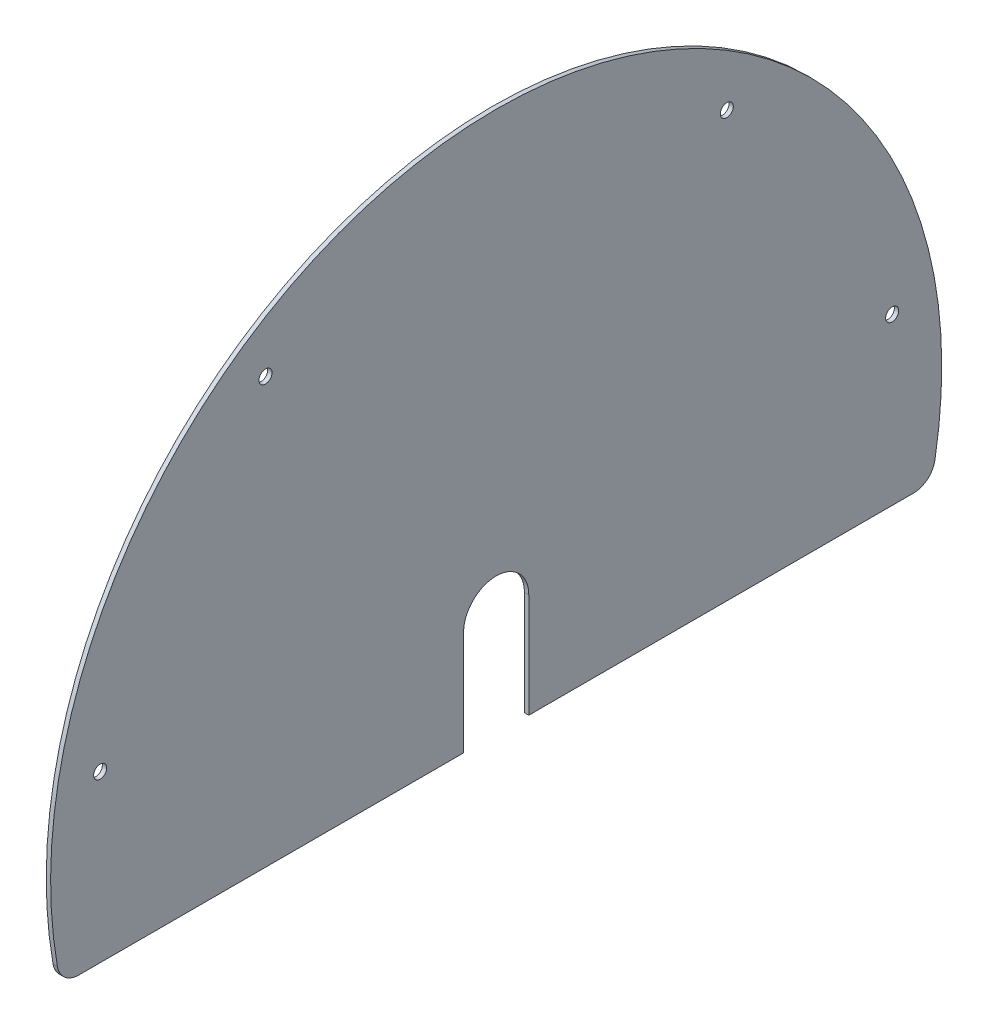
ISO-10303-21;
HEADER;
FILE_DESCRIPTION(('STEP AP214'),'2;1');
FILE_NAME('part.step','',(''),(''),'','','');
FILE_SCHEMA(('AUTOMOTIVE_DESIGN { 1 0 10303 214 1 1 1 1 }'));
ENDSEC;
DATA;
#1=APPLICATION_CONTEXT('core data for automotive mechanical design processes');
#2=APPLICATION_PROTOCOL_DEFINITION('international standard','automotive_design',2000,#1);
#3=PRODUCT_CONTEXT('',#1,'mechanical');
#4=PRODUCT('Part','Part','',(#3));
#5=PRODUCT_RELATED_PRODUCT_CATEGORY('part','',(#4));
#6=PRODUCT_DEFINITION_FORMATION('','',#4);
#7=PRODUCT_DEFINITION_CONTEXT('part definition',#1,'design');
#8=PRODUCT_DEFINITION('design','',#6,#7);
#9=PRODUCT_DEFINITION_SHAPE('','',#8);
#10=(LENGTH_UNIT() NAMED_UNIT(*) SI_UNIT(.MILLI.,.METRE.));
#11=(NAMED_UNIT(*) PLANE_ANGLE_UNIT() SI_UNIT($,.RADIAN.));
#12=(NAMED_UNIT(*) SI_UNIT($,.STERADIAN.) SOLID_ANGLE_UNIT());
#13=UNCERTAINTY_MEASURE_WITH_UNIT(LENGTH_MEASURE(1.E-05),#10,'distance_accuracy_value','');
#14=(GEOMETRIC_REPRESENTATION_CONTEXT(3) GLOBAL_UNCERTAINTY_ASSIGNED_CONTEXT((#13)) GLOBAL_UNIT_ASSIGNED_CONTEXT((#10,
#11,#12)) REPRESENTATION_CONTEXT('',''));
#15=CARTESIAN_POINT('',(0.,0.,0.));
#16=DIRECTION('',(0.,0.,1.));
#17=DIRECTION('',(1.,0.,0.));
#18=AXIS2_PLACEMENT_3D('',#15,#16,#17);
#19=CARTESIAN_POINT('',(-2.,48.,15.));
#20=DIRECTION('',(0.,0.,-1.));
#21=DIRECTION('',(0.,1.,0.));
#22=AXIS2_PLACEMENT_3D('',#19,#20,#21);
#23=PLANE('',#22);
#24=DIRECTION('',(0.,1.,0.));
#25=VECTOR('',#24,1.);
#26=CARTESIAN_POINT('',(0.,48.,15.));
#27=LINE('',#26,#25);
#28=CARTESIAN_POINT('',(0.,0.,15.));
#29=VERTEX_POINT('',#28);
#30=CARTESIAN_POINT('',(0.,48.,15.));
#31=VERTEX_POINT('',#30);
#32=EDGE_CURVE('E138',#29,#31,#27,.T.);
#33=ORIENTED_EDGE('',*,*,#32,.F.);
#34=DIRECTION('',(1.,0.,0.));
#35=VECTOR('',#34,1.);
#36=CARTESIAN_POINT('',(-2.,0.,15.));
#37=LINE('',#36,#35);
#38=CARTESIAN_POINT('',(-2.,0.,15.));
#39=VERTEX_POINT('',#38);
#40=EDGE_CURVE('E122',#39,#29,#37,.T.);
#41=ORIENTED_EDGE('',*,*,#40,.F.);
#42=DIRECTION('',(0.,1.,0.));
#43=VECTOR('',#42,1.);
#44=CARTESIAN_POINT('',(-2.,48.,15.));
#45=LINE('',#44,#43);
#46=CARTESIAN_POINT('',(-2.,48.,15.));
#47=VERTEX_POINT('',#46);
#48=EDGE_CURVE('E115',#39,#47,#45,.T.);
#49=ORIENTED_EDGE('',*,*,#48,.T.);
#50=DIRECTION('',(1.,0.,0.));
#51=VECTOR('',#50,1.);
#52=CARTESIAN_POINT('',(-2.,48.,15.));
#53=LINE('',#52,#51);
#54=EDGE_CURVE('E99',#47,#31,#53,.T.);
#55=ORIENTED_EDGE('',*,*,#54,.T.);
#56=EDGE_LOOP('',(#33,#41,#49,#55));
#57=FACE_BOUND('',#56,.T.);
#58=ADVANCED_FACE('F34',(#57),#23,.T.);
#59=CARTESIAN_POINT('',(-2.,0.,15.));
#60=DIRECTION('',(0.,-1.,0.));
#61=DIRECTION('',(0.,0.,-1.));
#62=AXIS2_PLACEMENT_3D('',#59,#60,#61);
#63=PLANE('',#62);
#64=DIRECTION('',(0.,0.,-1.));
#65=VECTOR('',#64,1.);
#66=CARTESIAN_POINT('',(0.,0.,15.));
#67=LINE('',#66,#65);
#68=CARTESIAN_POINT('',(0.,0.,192.013020391847));
#69=VERTEX_POINT('',#68);
#70=EDGE_CURVE('E123',#69,#29,#67,.T.);
#71=ORIENTED_EDGE('',*,*,#70,.F.);
#72=DIRECTION('',(1.,0.,0.));
#73=VECTOR('',#72,1.);
#74=CARTESIAN_POINT('',(-2.,0.,192.013020391847));
#75=LINE('',#74,#73);
#76=CARTESIAN_POINT('',(-2.,0.,192.013020391847));
#77=VERTEX_POINT('',#76);
#78=EDGE_CURVE('E11',#69,#77,#75,.F.);
#79=ORIENTED_EDGE('',*,*,#78,.T.);
#80=DIRECTION('',(0.,0.,-1.));
#81=VECTOR('',#80,1.);
#82=CARTESIAN_POINT('',(-2.,0.,15.));
#83=LINE('',#82,#81);
#84=EDGE_CURVE('E110',#77,#39,#83,.T.);
#85=ORIENTED_EDGE('',*,*,#84,.T.);
#86=ORIENTED_EDGE('',*,*,#40,.T.);
#87=EDGE_LOOP('',(#71,#79,#85,#86));
#88=FACE_BOUND('',#87,.T.);
#89=ADVANCED_FACE('F181',(#88),#63,.T.);
#90=CARTESIAN_POINT('',(-2.,44.,0.));
#91=DIRECTION('',(1.,0.,0.));
#92=DIRECTION('',(0.,0.,-1.));
#93=AXIS2_PLACEMENT_3D('',#90,#91,#92);
#94=CYLINDRICAL_SURFACE('',#93,205.);
#95=CARTESIAN_POINT('',(0.,44.,0.));
#96=DIRECTION('',(1.,0.,0.));
#97=DIRECTION('',(0.,0.,1.));
#98=AXIS2_PLACEMENT_3D('',#95,#96,#97);
#99=CIRCLE('',#98,205.);
#100=CARTESIAN_POINT('',(0.,8.25641025641025,-201.859841950404));
#101=VERTEX_POINT('',#100);
#102=CARTESIAN_POINT('',(0.,8.25641025641026,201.859841950404));
#103=VERTEX_POINT('',#102);
#104=EDGE_CURVE('E125',#101,#103,#99,.T.);
#105=ORIENTED_EDGE('',*,*,#104,.F.);
#106=DIRECTION('',(1.,0.,0.));
#107=VECTOR('',#106,1.);
#108=CARTESIAN_POINT('',(-2.,8.25641025641025,-201.859841950404));
#109=LINE('',#108,#107);
#110=CARTESIAN_POINT('',(-2.,8.25641025641025,-201.859841950404));
#111=VERTEX_POINT('',#110);
#112=EDGE_CURVE('E164',#101,#111,#109,.F.);
#113=ORIENTED_EDGE('',*,*,#112,.T.);
#114=CARTESIAN_POINT('',(-2.,44.,0.));
#115=DIRECTION('',(1.,0.,0.));
#116=DIRECTION('',(0.,0.,1.));
#117=AXIS2_PLACEMENT_3D('',#114,#115,#116);
#118=CIRCLE('',#117,205.);
#119=CARTESIAN_POINT('',(-2.,8.25641025641026,201.859841950404));
#120=VERTEX_POINT('',#119);
#121=EDGE_CURVE('E135',#111,#120,#118,.T.);
#122=ORIENTED_EDGE('',*,*,#121,.T.);
#123=DIRECTION('',(1.,0.,0.));
#124=VECTOR('',#123,1.);
#125=CARTESIAN_POINT('',(-2.,8.25641025641026,201.859841950404));
#126=LINE('',#125,#124);
#127=EDGE_CURVE('E161',#120,#103,#126,.T.);
#128=ORIENTED_EDGE('',*,*,#127,.T.);
#129=EDGE_LOOP('',(#105,#113,#122,#128));
#130=FACE_BOUND('',#129,.T.);
#131=ADVANCED_FACE('F178',(#130),#94,.T.);
#132=CARTESIAN_POINT('',(-2.,0.,-15.));
#133=DIRECTION('',(0.,-1.,0.));
#134=DIRECTION('',(0.,0.,-1.));
#135=AXIS2_PLACEMENT_3D('',#132,#133,#134);
#136=PLANE('',#135);
#137=DIRECTION('',(0.,0.,-1.));
#138=VECTOR('',#137,1.);
#139=CARTESIAN_POINT('',(-2.,0.,-15.));
#140=LINE('',#139,#138);
#141=CARTESIAN_POINT('',(-2.,0.,-15.));
#142=VERTEX_POINT('',#141);
#143=CARTESIAN_POINT('',(-2.,0.,-192.013020391847));
#144=VERTEX_POINT('',#143);
#145=EDGE_CURVE('E132',#142,#144,#140,.T.);
#146=ORIENTED_EDGE('',*,*,#145,.T.);
#147=DIRECTION('',(1.,0.,0.));
#148=VECTOR('',#147,1.);
#149=CARTESIAN_POINT('',(-2.,0.,-192.013020391847));
#150=LINE('',#149,#148);
#151=CARTESIAN_POINT('',(0.,0.,-192.013020391847));
#152=VERTEX_POINT('',#151);
#153=EDGE_CURVE('E151',#144,#152,#150,.T.);
#154=ORIENTED_EDGE('',*,*,#153,.T.);
#155=DIRECTION('',(0.,0.,-1.));
#156=VECTOR('',#155,1.);
#157=CARTESIAN_POINT('',(0.,0.,-15.));
#158=LINE('',#157,#156);
#159=CARTESIAN_POINT('',(0.,0.,-15.));
#160=VERTEX_POINT('',#159);
#161=EDGE_CURVE('E145',#160,#152,#158,.T.);
#162=ORIENTED_EDGE('',*,*,#161,.F.);
#163=DIRECTION('',(1.,0.,0.));
#164=VECTOR('',#163,1.);
#165=CARTESIAN_POINT('',(-2.,0.,-15.));
#166=LINE('',#165,#164);
#167=EDGE_CURVE('E152',#142,#160,#166,.T.);
#168=ORIENTED_EDGE('',*,*,#167,.F.);
#169=EDGE_LOOP('',(#146,#154,#162,#168));
#170=FACE_BOUND('',#169,.T.);
#171=ADVANCED_FACE('F171',(#170),#136,.T.);
#172=CARTESIAN_POINT('',(-2.,48.,-15.));
#173=DIRECTION('',(0.,0.,1.));
#174=DIRECTION('',(0.,-1.,0.));
#175=AXIS2_PLACEMENT_3D('',#172,#173,#174);
#176=PLANE('',#175);
#177=DIRECTION('',(0.,-1.,0.));
#178=VECTOR('',#177,1.);
#179=CARTESIAN_POINT('',(0.,48.,-15.));
#180=LINE('',#179,#178);
#181=CARTESIAN_POINT('',(0.,48.,-15.));
#182=VERTEX_POINT('',#181);
#183=EDGE_CURVE('E142',#182,#160,#180,.T.);
#184=ORIENTED_EDGE('',*,*,#183,.F.);
#185=DIRECTION('',(1.,0.,0.));
#186=VECTOR('',#185,1.);
#187=CARTESIAN_POINT('',(-2.,48.,-15.));
#188=LINE('',#187,#186);
#189=CARTESIAN_POINT('',(-2.,48.,-15.));
#190=VERTEX_POINT('',#189);
#191=EDGE_CURVE('E109',#190,#182,#188,.T.);
#192=ORIENTED_EDGE('',*,*,#191,.F.);
#193=DIRECTION('',(0.,-1.,0.));
#194=VECTOR('',#193,1.);
#195=CARTESIAN_POINT('',(-2.,48.,-15.));
#196=LINE('',#195,#194);
#197=EDGE_CURVE('E118',#190,#142,#196,.T.);
#198=ORIENTED_EDGE('',*,*,#197,.T.);
#199=ORIENTED_EDGE('',*,*,#167,.T.);
#200=EDGE_LOOP('',(#184,#192,#198,#199));
#201=FACE_BOUND('',#200,.T.);
#202=ADVANCED_FACE('F184',(#201),#176,.T.);
#203=CARTESIAN_POINT('',(-2.,48.,0.));
#204=DIRECTION('',(1.,0.,0.));
#205=DIRECTION('',(0.,0.,-1.));
#206=AXIS2_PLACEMENT_3D('',#203,#204,#205);
#207=CYLINDRICAL_SURFACE('',#206,15.);
#208=CARTESIAN_POINT('',(0.,48.,0.));
#209=DIRECTION('',(-1.,0.,0.));
#210=DIRECTION('',(0.,0.,1.));
#211=AXIS2_PLACEMENT_3D('',#208,#209,#210);
#212=CIRCLE('',#211,15.);
#213=EDGE_CURVE('E104',#31,#182,#212,.T.);
#214=ORIENTED_EDGE('',*,*,#213,.F.);
#215=ORIENTED_EDGE('',*,*,#54,.F.);
#216=CARTESIAN_POINT('',(-2.,48.,0.));
#217=DIRECTION('',(-1.,0.,0.));
#218=DIRECTION('',(0.,0.,1.));
#219=AXIS2_PLACEMENT_3D('',#216,#217,#218);
#220=CIRCLE('',#219,15.);
#221=EDGE_CURVE('E102',#47,#190,#220,.T.);
#222=ORIENTED_EDGE('',*,*,#221,.T.);
#223=ORIENTED_EDGE('',*,*,#191,.T.);
#224=EDGE_LOOP('',(#214,#215,#222,#223));
#225=FACE_BOUND('',#224,.T.);
#226=ADVANCED_FACE('F101',(#225),#207,.F.);
#227=CARTESIAN_POINT('',(-2.,44.,0.));
#228=DIRECTION('',(-1.,0.,0.));
#229=DIRECTION('',(0.,0.,1.));
#230=AXIS2_PLACEMENT_3D('',#227,#228,#229);
#231=PLANE('',#230);
#232=CARTESIAN_POINT('',(-2.,76.1249128683808,-182.189434307259));
#233=DIRECTION('',(-1.,0.,0.));
#234=DIRECTION('',(0.,0.,1.));
#235=AXIS2_PLACEMENT_3D('',#232,#233,#234);
#236=CIRCLE('',#235,2.99999999999999);
#237=CARTESIAN_POINT('',(-2.,76.1249128683808,-179.189434307259));
#238=VERTEX_POINT('',#237);
#239=EDGE_CURVE('E342',#238,#238,#236,.T.);
#240=ORIENTED_EDGE('',*,*,#239,.F.);
#241=EDGE_LOOP('',(#240));
#242=FACE_BOUND('',#241,.T.);
#243=CARTESIAN_POINT('',(-2.,195.543128193463,-106.111640724944));
#244=DIRECTION('',(-1.,0.,0.));
#245=DIRECTION('',(0.,0.,1.));
#246=AXIS2_PLACEMENT_3D('',#243,#244,#245);
#247=CIRCLE('',#246,3.00000000000001);
#248=CARTESIAN_POINT('',(-2.,195.543128193463,-103.111640724944));
#249=VERTEX_POINT('',#248);
#250=EDGE_CURVE('E345',#249,#249,#247,.T.);
#251=ORIENTED_EDGE('',*,*,#250,.F.);
#252=EDGE_LOOP('',(#251));
#253=FACE_BOUND('',#252,.T.);
#254=CARTESIAN_POINT('',(-2.,76.1249128683808,182.189434307259));
#255=DIRECTION('',(-1.,0.,0.));
#256=DIRECTION('',(0.,0.,1.));
#257=AXIS2_PLACEMENT_3D('',#254,#255,#256);
#258=CIRCLE('',#257,2.99999999999999);
#259=CARTESIAN_POINT('',(-2.,76.1249128683808,185.189434307259));
#260=VERTEX_POINT('',#259);
#261=EDGE_CURVE('E338',#260,#260,#258,.F.);
#262=ORIENTED_EDGE('',*,*,#261,.T.);
#263=EDGE_LOOP('',(#262));
#264=FACE_BOUND('',#263,.T.);
#265=CARTESIAN_POINT('',(-2.,195.543128193463,106.111640724944));
#266=DIRECTION('',(-1.,0.,0.));
#267=DIRECTION('',(0.,0.,1.));
#268=AXIS2_PLACEMENT_3D('',#265,#266,#267);
#269=CIRCLE('',#268,3.00000000000001);
#270=CARTESIAN_POINT('',(-2.,195.543128193463,109.111640724944));
#271=VERTEX_POINT('',#270);
#272=EDGE_CURVE('E128',#271,#271,#269,.F.);
#273=ORIENTED_EDGE('',*,*,#272,.T.);
#274=EDGE_LOOP('',(#273));
#275=FACE_BOUND('',#274,.T.);
#276=ORIENTED_EDGE('',*,*,#121,.F.);
#277=CARTESIAN_POINT('',(-2.,10.,-192.013020391847));
#278=DIRECTION('',(-1.,0.,0.));
#279=DIRECTION('',(0.,0.,1.));
#280=AXIS2_PLACEMENT_3D('',#277,#278,#279);
#281=CIRCLE('',#280,10.);
#282=EDGE_CURVE('E42',#111,#144,#281,.T.);
#283=ORIENTED_EDGE('',*,*,#282,.T.);
#284=ORIENTED_EDGE('',*,*,#145,.F.);
#285=ORIENTED_EDGE('',*,*,#197,.F.);
#286=ORIENTED_EDGE('',*,*,#221,.F.);
#287=ORIENTED_EDGE('',*,*,#48,.F.);
#288=ORIENTED_EDGE('',*,*,#84,.F.);
#289=CARTESIAN_POINT('',(-2.,10.,192.013020391847));
#290=DIRECTION('',(-1.,0.,0.));
#291=DIRECTION('',(0.,0.,1.));
#292=AXIS2_PLACEMENT_3D('',#289,#290,#291);
#293=CIRCLE('',#292,10.);
#294=EDGE_CURVE('E54',#77,#120,#293,.T.);
#295=ORIENTED_EDGE('',*,*,#294,.T.);
#296=EDGE_LOOP('',(#276,#283,#284,#285,#286,#287,#288,#295));
#297=FACE_BOUND('',#296,.T.);
#298=ADVANCED_FACE('F114',(#242,#253,#264,#275,#297),#231,.T.);
#299=CARTESIAN_POINT('',(0.,44.,0.));
#300=DIRECTION('',(-1.,0.,0.));
#301=DIRECTION('',(0.,0.,1.));
#302=AXIS2_PLACEMENT_3D('',#299,#300,#301);
#303=PLANE('',#302);
#304=CARTESIAN_POINT('',(0.,76.1249128683808,-182.189434307259));
#305=DIRECTION('',(-1.,0.,0.));
#306=DIRECTION('',(0.,0.,1.));
#307=AXIS2_PLACEMENT_3D('',#304,#305,#306);
#308=CIRCLE('',#307,2.99999999999999);
#309=CARTESIAN_POINT('',(0.,76.1249128683808,-179.189434307259));
#310=VERTEX_POINT('',#309);
#311=EDGE_CURVE('E326',#310,#310,#308,.T.);
#312=ORIENTED_EDGE('',*,*,#311,.T.);
#313=EDGE_LOOP('',(#312));
#314=FACE_BOUND('',#313,.T.);
#315=CARTESIAN_POINT('',(0.,195.543128193463,-106.111640724944));
#316=DIRECTION('',(-1.,0.,0.));
#317=DIRECTION('',(0.,0.,1.));
#318=AXIS2_PLACEMENT_3D('',#315,#316,#317);
#319=CIRCLE('',#318,3.00000000000001);
#320=CARTESIAN_POINT('',(0.,195.543128193463,-103.111640724944));
#321=VERTEX_POINT('',#320);
#322=EDGE_CURVE('E330',#321,#321,#319,.T.);
#323=ORIENTED_EDGE('',*,*,#322,.T.);
#324=EDGE_LOOP('',(#323));
#325=FACE_BOUND('',#324,.T.);
#326=CARTESIAN_POINT('',(0.,76.1249128683808,182.189434307259));
#327=DIRECTION('',(1.,0.,0.));
#328=DIRECTION('',(0.,0.,-1.));
#329=AXIS2_PLACEMENT_3D('',#326,#327,#328);
#330=CIRCLE('',#329,2.99999999999999);
#331=CARTESIAN_POINT('',(0.,76.1249128683808,179.189434307259));
#332=VERTEX_POINT('',#331);
#333=EDGE_CURVE('E140',#332,#332,#330,.T.);
#334=ORIENTED_EDGE('',*,*,#333,.F.);
#335=EDGE_LOOP('',(#334));
#336=FACE_BOUND('',#335,.T.);
#337=CARTESIAN_POINT('',(0.,195.543128193463,106.111640724944));
#338=DIRECTION('',(1.,0.,0.));
#339=DIRECTION('',(0.,0.,-1.));
#340=AXIS2_PLACEMENT_3D('',#337,#338,#339);
#341=CIRCLE('',#340,3.00000000000001);
#342=CARTESIAN_POINT('',(0.,195.543128193463,103.111640724944));
#343=VERTEX_POINT('',#342);
#344=EDGE_CURVE('E336',#343,#343,#341,.T.);
#345=ORIENTED_EDGE('',*,*,#344,.F.);
#346=EDGE_LOOP('',(#345));
#347=FACE_BOUND('',#346,.T.);
#348=ORIENTED_EDGE('',*,*,#161,.T.);
#349=CARTESIAN_POINT('',(0.,10.,-192.013020391847));
#350=DIRECTION('',(-1.,0.,0.));
#351=DIRECTION('',(0.,0.,1.));
#352=AXIS2_PLACEMENT_3D('',#349,#350,#351);
#353=CIRCLE('',#352,10.);
#354=EDGE_CURVE('E159',#152,#101,#353,.F.);
#355=ORIENTED_EDGE('',*,*,#354,.T.);
#356=ORIENTED_EDGE('',*,*,#104,.T.);
#357=CARTESIAN_POINT('',(0.,10.,192.013020391847));
#358=DIRECTION('',(-1.,0.,0.));
#359=DIRECTION('',(0.,0.,1.));
#360=AXIS2_PLACEMENT_3D('',#357,#358,#359);
#361=CIRCLE('',#360,10.);
#362=EDGE_CURVE('E157',#103,#69,#361,.F.);
#363=ORIENTED_EDGE('',*,*,#362,.T.);
#364=ORIENTED_EDGE('',*,*,#70,.T.);
#365=ORIENTED_EDGE('',*,*,#32,.T.);
#366=ORIENTED_EDGE('',*,*,#213,.T.);
#367=ORIENTED_EDGE('',*,*,#183,.T.);
#368=EDGE_LOOP('',(#348,#355,#356,#363,#364,#365,#366,#367));
#369=FACE_BOUND('',#368,.T.);
#370=ADVANCED_FACE('F176',(#314,#325,#336,#347,#369),#303,.F.);
#371=CARTESIAN_POINT('',(-2.001,195.543128193463,106.111640724944));
#372=DIRECTION('',(1.,0.,0.));
#373=DIRECTION('',(0.,0.,-1.));
#374=AXIS2_PLACEMENT_3D('',#371,#372,#373);
#375=CYLINDRICAL_SURFACE('',#374,3.00000000000001);
#376=ORIENTED_EDGE('',*,*,#272,.F.);
#377=EDGE_LOOP('',(#376));
#378=FACE_BOUND('',#377,.T.);
#379=ORIENTED_EDGE('',*,*,#344,.T.);
#380=EDGE_LOOP('',(#379));
#381=FACE_BOUND('',#380,.T.);
#382=ADVANCED_FACE('F219',(#378,#381),#375,.F.);
#383=CARTESIAN_POINT('',(-2.001,76.1249128683808,182.189434307259));
#384=DIRECTION('',(1.,0.,0.));
#385=DIRECTION('',(0.,0.,-1.));
#386=AXIS2_PLACEMENT_3D('',#383,#384,#385);
#387=CYLINDRICAL_SURFACE('',#386,2.99999999999999);
#388=ORIENTED_EDGE('',*,*,#261,.F.);
#389=EDGE_LOOP('',(#388));
#390=FACE_BOUND('',#389,.T.);
#391=ORIENTED_EDGE('',*,*,#333,.T.);
#392=EDGE_LOOP('',(#391));
#393=FACE_BOUND('',#392,.T.);
#394=ADVANCED_FACE('F211',(#390,#393),#387,.F.);
#395=CARTESIAN_POINT('',(-2.001,195.543128193463,-106.111640724944));
#396=DIRECTION('',(1.,0.,0.));
#397=DIRECTION('',(0.,0.,-1.));
#398=AXIS2_PLACEMENT_3D('',#395,#396,#397);
#399=CYLINDRICAL_SURFACE('',#398,3.00000000000001);
#400=ORIENTED_EDGE('',*,*,#250,.T.);
#401=EDGE_LOOP('',(#400));
#402=FACE_BOUND('',#401,.T.);
#403=ORIENTED_EDGE('',*,*,#322,.F.);
#404=EDGE_LOOP('',(#403));
#405=FACE_BOUND('',#404,.T.);
#406=ADVANCED_FACE('F205',(#402,#405),#399,.F.);
#407=CARTESIAN_POINT('',(-2.001,76.1249128683808,-182.189434307259));
#408=DIRECTION('',(1.,0.,0.));
#409=DIRECTION('',(0.,0.,-1.));
#410=AXIS2_PLACEMENT_3D('',#407,#408,#409);
#411=CYLINDRICAL_SURFACE('',#410,2.99999999999999);
#412=ORIENTED_EDGE('',*,*,#239,.T.);
#413=EDGE_LOOP('',(#412));
#414=FACE_BOUND('',#413,.T.);
#415=ORIENTED_EDGE('',*,*,#311,.F.);
#416=EDGE_LOOP('',(#415));
#417=FACE_BOUND('',#416,.T.);
#418=ADVANCED_FACE('F200',(#414,#417),#411,.F.);
#419=CARTESIAN_POINT('',(-2.,10.,-192.013020391847));
#420=DIRECTION('',(1.,0.,0.));
#421=DIRECTION('',(0.,0.,-1.));
#422=AXIS2_PLACEMENT_3D('',#419,#420,#421);
#423=CYLINDRICAL_SURFACE('',#422,10.);
#424=ORIENTED_EDGE('',*,*,#282,.F.);
#425=ORIENTED_EDGE('',*,*,#112,.F.);
#426=ORIENTED_EDGE('',*,*,#354,.F.);
#427=ORIENTED_EDGE('',*,*,#153,.F.);
#428=EDGE_LOOP('',(#424,#425,#426,#427));
#429=FACE_BOUND('',#428,.T.);
#430=ADVANCED_FACE('F173',(#429),#423,.T.);
#431=CARTESIAN_POINT('',(-2.,10.,192.013020391847));
#432=DIRECTION('',(1.,0.,0.));
#433=DIRECTION('',(0.,0.,-1.));
#434=AXIS2_PLACEMENT_3D('',#431,#432,#433);
#435=CYLINDRICAL_SURFACE('',#434,10.);
#436=ORIENTED_EDGE('',*,*,#294,.F.);
#437=ORIENTED_EDGE('',*,*,#78,.F.);
#438=ORIENTED_EDGE('',*,*,#362,.F.);
#439=ORIENTED_EDGE('',*,*,#127,.F.);
#440=EDGE_LOOP('',(#436,#437,#438,#439));
#441=FACE_BOUND('',#440,.T.);
#442=ADVANCED_FACE('F36',(#441),#435,.T.);
#443=CLOSED_SHELL('',(#58,#89,#131,#171,#202,#226,#298,#370,#382,#394,#406,#418,#430,#442));
#444=MANIFOLD_SOLID_BREP('B2',#443);
#445=ADVANCED_BREP_SHAPE_REPRESENTATION('',(#18,#444),#14);
#446=SHAPE_DEFINITION_REPRESENTATION(#9,#445);
ENDSEC;
END-ISO-10303-21;
